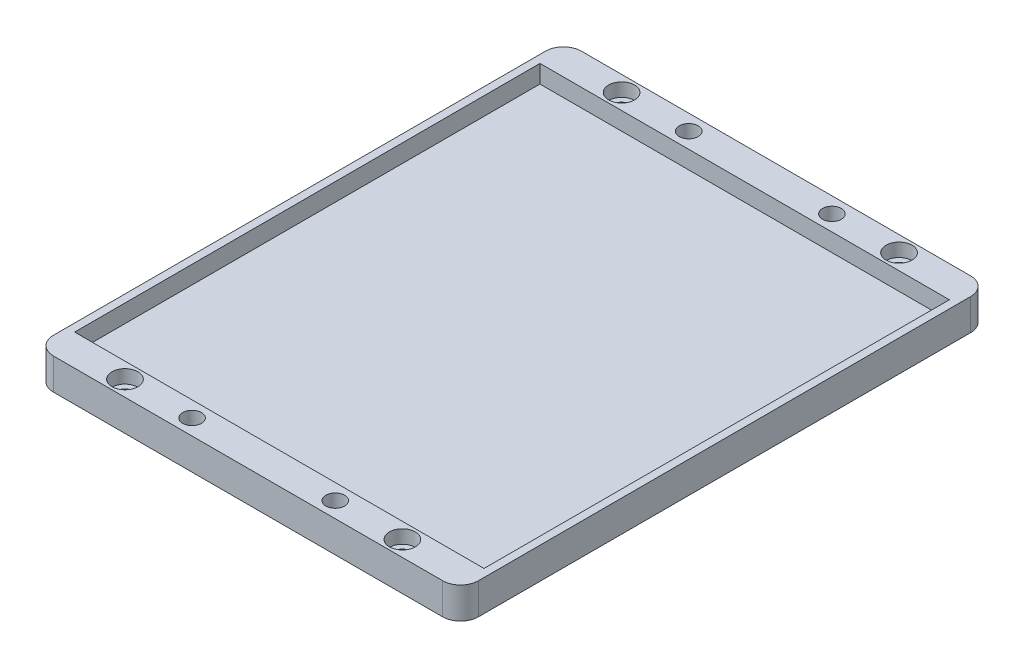
ISO-10303-21;
HEADER;
FILE_DESCRIPTION(('STEP AP214'),'2;1');
FILE_NAME('part.step','',(''),(''),'','','');
FILE_SCHEMA(('AUTOMOTIVE_DESIGN { 1 0 10303 214 1 1 1 1 }'));
ENDSEC;
DATA;
#1=APPLICATION_CONTEXT('core data for automotive mechanical design processes');
#2=APPLICATION_PROTOCOL_DEFINITION('international standard','automotive_design',2000,#1);
#3=PRODUCT_CONTEXT('',#1,'mechanical');
#4=PRODUCT('Part','Part','',(#3));
#5=PRODUCT_RELATED_PRODUCT_CATEGORY('part','',(#4));
#6=PRODUCT_DEFINITION_FORMATION('','',#4);
#7=PRODUCT_DEFINITION_CONTEXT('part definition',#1,'design');
#8=PRODUCT_DEFINITION('design','',#6,#7);
#9=PRODUCT_DEFINITION_SHAPE('','',#8);
#10=(LENGTH_UNIT() NAMED_UNIT(*) SI_UNIT(.MILLI.,.METRE.));
#11=(NAMED_UNIT(*) PLANE_ANGLE_UNIT() SI_UNIT($,.RADIAN.));
#12=(NAMED_UNIT(*) SI_UNIT($,.STERADIAN.) SOLID_ANGLE_UNIT());
#13=UNCERTAINTY_MEASURE_WITH_UNIT(LENGTH_MEASURE(1.E-05),#10,'distance_accuracy_value','');
#14=(GEOMETRIC_REPRESENTATION_CONTEXT(3) GLOBAL_UNCERTAINTY_ASSIGNED_CONTEXT((#13)) GLOBAL_UNIT_ASSIGNED_CONTEXT((#10,
#11,#12)) REPRESENTATION_CONTEXT('',''));
#15=CARTESIAN_POINT('',(0.,0.,0.));
#16=DIRECTION('',(0.,0.,1.));
#17=DIRECTION('',(1.,0.,0.));
#18=AXIS2_PLACEMENT_3D('',#15,#16,#17);
#19=CARTESIAN_POINT('',(31.,0.,-55.5));
#20=DIRECTION('',(0.,1.,0.));
#21=DIRECTION('',(0.,0.,1.));
#22=AXIS2_PLACEMENT_3D('',#19,#20,#21);
#23=CYLINDRICAL_SURFACE('',#22,1.60000000000001);
#24=CARTESIAN_POINT('',(31.,0.,-55.5));
#25=DIRECTION('',(0.,1.,0.));
#26=DIRECTION('',(0.,0.,-1.));
#27=AXIS2_PLACEMENT_3D('',#24,#25,#26);
#28=CIRCLE('',#27,1.60000000000001);
#29=CARTESIAN_POINT('',(31.,0.,-57.1));
#30=VERTEX_POINT('',#29);
#31=EDGE_CURVE('E292',#30,#30,#28,.T.);
#32=ORIENTED_EDGE('',*,*,#31,.F.);
#33=EDGE_LOOP('',(#32));
#34=FACE_BOUND('',#33,.T.);
#35=CARTESIAN_POINT('',(31.,4.,-55.5));
#36=DIRECTION('',(0.,1.,0.));
#37=DIRECTION('',(0.,0.,1.));
#38=AXIS2_PLACEMENT_3D('',#35,#36,#37);
#39=CIRCLE('',#38,1.60000000000001);
#40=CARTESIAN_POINT('',(31.,4.,-53.9));
#41=VERTEX_POINT('',#40);
#42=EDGE_CURVE('E276',#41,#41,#39,.F.);
#43=ORIENTED_EDGE('',*,*,#42,.F.);
#44=EDGE_LOOP('',(#43));
#45=FACE_BOUND('',#44,.T.);
#46=ADVANCED_FACE('F47',(#34,#45),#23,.F.);
#47=CARTESIAN_POINT('',(-31.,0.,55.5));
#48=DIRECTION('',(0.,1.,0.));
#49=DIRECTION('',(0.,0.,1.));
#50=AXIS2_PLACEMENT_3D('',#47,#48,#49);
#51=CYLINDRICAL_SURFACE('',#50,1.6);
#52=CARTESIAN_POINT('',(-31.,0.,55.5));
#53=DIRECTION('',(0.,1.,0.));
#54=DIRECTION('',(0.,0.,1.));
#55=AXIS2_PLACEMENT_3D('',#52,#53,#54);
#56=CIRCLE('',#55,1.6);
#57=CARTESIAN_POINT('',(-31.,0.,57.1));
#58=VERTEX_POINT('',#57);
#59=EDGE_CURVE('E298',#58,#58,#56,.T.);
#60=ORIENTED_EDGE('',*,*,#59,.F.);
#61=EDGE_LOOP('',(#60));
#62=FACE_BOUND('',#61,.T.);
#63=CARTESIAN_POINT('',(-31.,4.,55.5));
#64=DIRECTION('',(0.,1.,0.));
#65=DIRECTION('',(0.,0.,1.));
#66=AXIS2_PLACEMENT_3D('',#63,#64,#65);
#67=CIRCLE('',#66,1.6);
#68=CARTESIAN_POINT('',(-31.,4.,57.1));
#69=VERTEX_POINT('',#68);
#70=EDGE_CURVE('E272',#69,#69,#67,.F.);
#71=ORIENTED_EDGE('',*,*,#70,.F.);
#72=EDGE_LOOP('',(#71));
#73=FACE_BOUND('',#72,.T.);
#74=ADVANCED_FACE('F328',(#62,#73),#51,.F.);
#75=CARTESIAN_POINT('',(47.5,7.,-59.));
#76=DIRECTION('',(-1.,0.,0.));
#77=DIRECTION('',(0.,0.,1.));
#78=AXIS2_PLACEMENT_3D('',#75,#76,#77);
#79=PLANE('',#78);
#80=DIRECTION('',(0.,0.,-1.));
#81=VECTOR('',#80,1.);
#82=CARTESIAN_POINT('',(47.5,0.,-59.));
#83=LINE('',#82,#81);
#84=CARTESIAN_POINT('',(47.5,0.,55.));
#85=VERTEX_POINT('',#84);
#86=CARTESIAN_POINT('',(47.5,0.,-55.));
#87=VERTEX_POINT('',#86);
#88=EDGE_CURVE('E191',#85,#87,#83,.T.);
#89=ORIENTED_EDGE('',*,*,#88,.T.);
#90=DIRECTION('',(0.,-1.,0.));
#91=VECTOR('',#90,1.);
#92=CARTESIAN_POINT('',(47.5,7.,-55.));
#93=LINE('',#92,#91);
#94=CARTESIAN_POINT('',(47.5,7.,-55.));
#95=VERTEX_POINT('',#94);
#96=EDGE_CURVE('E248',#87,#95,#93,.F.);
#97=ORIENTED_EDGE('',*,*,#96,.T.);
#98=DIRECTION('',(0.,0.,-1.));
#99=VECTOR('',#98,1.);
#100=CARTESIAN_POINT('',(47.5,7.,-59.));
#101=LINE('',#100,#99);
#102=CARTESIAN_POINT('',(47.5,7.,55.));
#103=VERTEX_POINT('',#102);
#104=EDGE_CURVE('E197',#103,#95,#101,.T.);
#105=ORIENTED_EDGE('',*,*,#104,.F.);
#106=DIRECTION('',(0.,-1.,0.));
#107=VECTOR('',#106,1.);
#108=CARTESIAN_POINT('',(47.5,7.,55.));
#109=LINE('',#108,#107);
#110=EDGE_CURVE('E244',#103,#85,#109,.T.);
#111=ORIENTED_EDGE('',*,*,#110,.T.);
#112=EDGE_LOOP('',(#89,#97,#105,#111));
#113=FACE_BOUND('',#112,.T.);
#114=ADVANCED_FACE('F333',(#113),#79,.F.);
#115=CARTESIAN_POINT('',(-47.5,7.,-59.));
#116=DIRECTION('',(0.,0.,1.));
#117=DIRECTION('',(1.,0.,0.));
#118=AXIS2_PLACEMENT_3D('',#115,#116,#117);
#119=PLANE('',#118);
#120=DIRECTION('',(-1.,0.,0.));
#121=VECTOR('',#120,1.);
#122=CARTESIAN_POINT('',(-47.5,7.,-59.));
#123=LINE('',#122,#121);
#124=CARTESIAN_POINT('',(43.5,7.,-59.));
#125=VERTEX_POINT('',#124);
#126=CARTESIAN_POINT('',(-43.5,7.,-59.));
#127=VERTEX_POINT('',#126);
#128=EDGE_CURVE('E201',#125,#127,#123,.T.);
#129=ORIENTED_EDGE('',*,*,#128,.F.);
#130=DIRECTION('',(0.,-1.,0.));
#131=VECTOR('',#130,1.);
#132=CARTESIAN_POINT('',(43.5,7.,-59.));
#133=LINE('',#132,#131);
#134=CARTESIAN_POINT('',(43.5,0.,-59.));
#135=VERTEX_POINT('',#134);
#136=EDGE_CURVE('E228',#125,#135,#133,.T.);
#137=ORIENTED_EDGE('',*,*,#136,.T.);
#138=DIRECTION('',(-1.,0.,0.));
#139=VECTOR('',#138,1.);
#140=CARTESIAN_POINT('',(-47.5,0.,-59.));
#141=LINE('',#140,#139);
#142=CARTESIAN_POINT('',(-43.5,0.,-59.));
#143=VERTEX_POINT('',#142);
#144=EDGE_CURVE('E216',#135,#143,#141,.T.);
#145=ORIENTED_EDGE('',*,*,#144,.T.);
#146=DIRECTION('',(0.,-1.,0.));
#147=VECTOR('',#146,1.);
#148=CARTESIAN_POINT('',(-43.5,7.,-59.));
#149=LINE('',#148,#147);
#150=EDGE_CURVE('E212',#143,#127,#149,.F.);
#151=ORIENTED_EDGE('',*,*,#150,.T.);
#152=EDGE_LOOP('',(#129,#137,#145,#151));
#153=FACE_BOUND('',#152,.T.);
#154=ADVANCED_FACE('F490',(#153),#119,.F.);
#155=CARTESIAN_POINT('',(-47.5,7.,-59.));
#156=DIRECTION('',(1.,0.,0.));
#157=DIRECTION('',(0.,0.,-1.));
#158=AXIS2_PLACEMENT_3D('',#155,#156,#157);
#159=PLANE('',#158);
#160=DIRECTION('',(0.,0.,1.));
#161=VECTOR('',#160,1.);
#162=CARTESIAN_POINT('',(-47.5,7.,-59.));
#163=LINE('',#162,#161);
#164=CARTESIAN_POINT('',(-47.5,7.,-55.));
#165=VERTEX_POINT('',#164);
#166=CARTESIAN_POINT('',(-47.5,7.,55.));
#167=VERTEX_POINT('',#166);
#168=EDGE_CURVE('E206',#165,#167,#163,.T.);
#169=ORIENTED_EDGE('',*,*,#168,.F.);
#170=DIRECTION('',(0.,-1.,0.));
#171=VECTOR('',#170,1.);
#172=CARTESIAN_POINT('',(-47.5,7.,-55.));
#173=LINE('',#172,#171);
#174=CARTESIAN_POINT('',(-47.5,0.,-55.));
#175=VERTEX_POINT('',#174);
#176=EDGE_CURVE('E265',#165,#175,#173,.T.);
#177=ORIENTED_EDGE('',*,*,#176,.T.);
#178=DIRECTION('',(0.,0.,1.));
#179=VECTOR('',#178,1.);
#180=CARTESIAN_POINT('',(-47.5,0.,-59.));
#181=LINE('',#180,#179);
#182=CARTESIAN_POINT('',(-47.5,0.,55.));
#183=VERTEX_POINT('',#182);
#184=EDGE_CURVE('E220',#175,#183,#181,.T.);
#185=ORIENTED_EDGE('',*,*,#184,.T.);
#186=DIRECTION('',(0.,-1.,0.));
#187=VECTOR('',#186,1.);
#188=CARTESIAN_POINT('',(-47.5,7.,55.));
#189=LINE('',#188,#187);
#190=EDGE_CURVE('E262',#183,#167,#189,.F.);
#191=ORIENTED_EDGE('',*,*,#190,.T.);
#192=EDGE_LOOP('',(#169,#177,#185,#191));
#193=FACE_BOUND('',#192,.T.);
#194=ADVANCED_FACE('F500',(#193),#159,.F.);
#195=CARTESIAN_POINT('',(-47.5,7.,59.));
#196=DIRECTION('',(0.,0.,-1.));
#197=DIRECTION('',(-1.,0.,0.));
#198=AXIS2_PLACEMENT_3D('',#195,#196,#197);
#199=PLANE('',#198);
#200=DIRECTION('',(1.,0.,0.));
#201=VECTOR('',#200,1.);
#202=CARTESIAN_POINT('',(-47.5,0.,59.));
#203=LINE('',#202,#201);
#204=CARTESIAN_POINT('',(-43.5,0.,59.));
#205=VERTEX_POINT('',#204);
#206=CARTESIAN_POINT('',(43.5,0.,59.));
#207=VERTEX_POINT('',#206);
#208=EDGE_CURVE('E202',#205,#207,#203,.T.);
#209=ORIENTED_EDGE('',*,*,#208,.T.);
#210=DIRECTION('',(0.,-1.,0.));
#211=VECTOR('',#210,1.);
#212=CARTESIAN_POINT('',(43.5,7.,59.));
#213=LINE('',#212,#211);
#214=CARTESIAN_POINT('',(43.5,7.,59.));
#215=VERTEX_POINT('',#214);
#216=EDGE_CURVE('E11',#207,#215,#213,.F.);
#217=ORIENTED_EDGE('',*,*,#216,.T.);
#218=DIRECTION('',(1.,0.,0.));
#219=VECTOR('',#218,1.);
#220=CARTESIAN_POINT('',(-47.5,7.,59.));
#221=LINE('',#220,#219);
#222=CARTESIAN_POINT('',(-43.5,7.,59.));
#223=VERTEX_POINT('',#222);
#224=EDGE_CURVE('E209',#223,#215,#221,.T.);
#225=ORIENTED_EDGE('',*,*,#224,.F.);
#226=DIRECTION('',(0.,-1.,0.));
#227=VECTOR('',#226,1.);
#228=CARTESIAN_POINT('',(-43.5,7.,59.));
#229=LINE('',#228,#227);
#230=EDGE_CURVE('E57',#223,#205,#229,.T.);
#231=ORIENTED_EDGE('',*,*,#230,.T.);
#232=EDGE_LOOP('',(#209,#217,#225,#231));
#233=FACE_BOUND('',#232,.T.);
#234=ADVANCED_FACE('F475',(#233),#199,.F.);
#235=CARTESIAN_POINT('',(0.,7.,0.));
#236=DIRECTION('',(0.,1.,0.));
#237=DIRECTION('',(0.,0.,1.));
#238=AXIS2_PLACEMENT_3D('',#235,#236,#237);
#239=PLANE('',#238);
#240=CARTESIAN_POINT('',(16.,7.,55.5));
#241=DIRECTION('',(0.,1.,0.));
#242=DIRECTION('',(0.,0.,-1.));
#243=AXIS2_PLACEMENT_3D('',#240,#241,#242);
#244=CIRCLE('',#243,2.1);
#245=CARTESIAN_POINT('',(16.,7.,53.4));
#246=VERTEX_POINT('',#245);
#247=EDGE_CURVE('E430',#246,#246,#244,.T.);
#248=ORIENTED_EDGE('',*,*,#247,.F.);
#249=EDGE_LOOP('',(#248));
#250=FACE_BOUND('',#249,.T.);
#251=CARTESIAN_POINT('',(16.,7.,-55.5));
#252=DIRECTION('',(0.,1.,0.));
#253=DIRECTION('',(0.,0.,1.));
#254=AXIS2_PLACEMENT_3D('',#251,#252,#253);
#255=CIRCLE('',#254,2.1);
#256=CARTESIAN_POINT('',(16.,7.,-53.4));
#257=VERTEX_POINT('',#256);
#258=EDGE_CURVE('E420',#257,#257,#255,.T.);
#259=ORIENTED_EDGE('',*,*,#258,.F.);
#260=EDGE_LOOP('',(#259));
#261=FACE_BOUND('',#260,.T.);
#262=CARTESIAN_POINT('',(-16.,7.,-55.5));
#263=DIRECTION('',(0.,1.,0.));
#264=DIRECTION('',(0.,0.,-1.));
#265=AXIS2_PLACEMENT_3D('',#262,#263,#264);
#266=CIRCLE('',#265,2.1);
#267=CARTESIAN_POINT('',(-16.,7.,-57.6));
#268=VERTEX_POINT('',#267);
#269=EDGE_CURVE('E410',#268,#268,#266,.T.);
#270=ORIENTED_EDGE('',*,*,#269,.F.);
#271=EDGE_LOOP('',(#270));
#272=FACE_BOUND('',#271,.T.);
#273=CARTESIAN_POINT('',(-16.,7.,55.5));
#274=DIRECTION('',(0.,1.,0.));
#275=DIRECTION('',(0.,0.,1.));
#276=AXIS2_PLACEMENT_3D('',#273,#274,#275);
#277=CIRCLE('',#276,2.1);
#278=CARTESIAN_POINT('',(-16.,7.,57.6));
#279=VERTEX_POINT('',#278);
#280=EDGE_CURVE('E413',#279,#279,#277,.T.);
#281=ORIENTED_EDGE('',*,*,#280,.F.);
#282=EDGE_LOOP('',(#281));
#283=FACE_BOUND('',#282,.T.);
#284=CARTESIAN_POINT('',(-31.,7.,-55.5));
#285=DIRECTION('',(0.,1.,0.));
#286=DIRECTION('',(0.,0.,-1.));
#287=AXIS2_PLACEMENT_3D('',#284,#285,#286);
#288=CIRCLE('',#287,2.9);
#289=CARTESIAN_POINT('',(-31.,7.,-58.4));
#290=VERTEX_POINT('',#289);
#291=EDGE_CURVE('E450',#290,#290,#288,.T.);
#292=ORIENTED_EDGE('',*,*,#291,.F.);
#293=EDGE_LOOP('',(#292));
#294=FACE_BOUND('',#293,.T.);
#295=CARTESIAN_POINT('',(31.,7.,55.5));
#296=DIRECTION('',(0.,1.,0.));
#297=DIRECTION('',(0.,0.,-1.));
#298=AXIS2_PLACEMENT_3D('',#295,#296,#297);
#299=CIRCLE('',#298,2.9);
#300=CARTESIAN_POINT('',(31.,7.,52.6));
#301=VERTEX_POINT('',#300);
#302=EDGE_CURVE('E458',#301,#301,#299,.T.);
#303=ORIENTED_EDGE('',*,*,#302,.F.);
#304=EDGE_LOOP('',(#303));
#305=FACE_BOUND('',#304,.T.);
#306=CARTESIAN_POINT('',(31.,7.,-55.5));
#307=DIRECTION('',(0.,1.,0.));
#308=DIRECTION('',(0.,0.,1.));
#309=AXIS2_PLACEMENT_3D('',#306,#307,#308);
#310=CIRCLE('',#309,2.9);
#311=CARTESIAN_POINT('',(31.,7.,-52.6));
#312=VERTEX_POINT('',#311);
#313=EDGE_CURVE('E442',#312,#312,#310,.T.);
#314=ORIENTED_EDGE('',*,*,#313,.F.);
#315=EDGE_LOOP('',(#314));
#316=FACE_BOUND('',#315,.T.);
#317=CARTESIAN_POINT('',(-31.,7.,55.5));
#318=DIRECTION('',(0.,1.,0.));
#319=DIRECTION('',(0.,0.,1.));
#320=AXIS2_PLACEMENT_3D('',#317,#318,#319);
#321=CIRCLE('',#320,2.9);
#322=CARTESIAN_POINT('',(-31.,7.,58.4));
#323=VERTEX_POINT('',#322);
#324=EDGE_CURVE('E301',#323,#323,#321,.T.);
#325=ORIENTED_EDGE('',*,*,#324,.F.);
#326=EDGE_LOOP('',(#325));
#327=FACE_BOUND('',#326,.T.);
#328=DIRECTION('',(0.,0.,-1.));
#329=VECTOR('',#328,1.);
#330=CARTESIAN_POINT('',(45.75,7.,52.));
#331=LINE('',#330,#329);
#332=CARTESIAN_POINT('',(45.75,7.,52.));
#333=VERTEX_POINT('',#332);
#334=CARTESIAN_POINT('',(45.75,7.,-52.));
#335=VERTEX_POINT('',#334);
#336=EDGE_CURVE('E146',#333,#335,#331,.T.);
#337=ORIENTED_EDGE('',*,*,#336,.F.);
#338=DIRECTION('',(1.,0.,0.));
#339=VECTOR('',#338,1.);
#340=CARTESIAN_POINT('',(-45.75,7.,52.));
#341=LINE('',#340,#339);
#342=CARTESIAN_POINT('',(-45.75,7.,52.));
#343=VERTEX_POINT('',#342);
#344=EDGE_CURVE('E166',#343,#333,#341,.T.);
#345=ORIENTED_EDGE('',*,*,#344,.F.);
#346=DIRECTION('',(0.,0.,1.));
#347=VECTOR('',#346,1.);
#348=CARTESIAN_POINT('',(-45.75,7.,52.));
#349=LINE('',#348,#347);
#350=CARTESIAN_POINT('',(-45.75,7.,-52.));
#351=VERTEX_POINT('',#350);
#352=EDGE_CURVE('E170',#351,#343,#349,.T.);
#353=ORIENTED_EDGE('',*,*,#352,.F.);
#354=DIRECTION('',(-1.,0.,0.));
#355=VECTOR('',#354,1.);
#356=CARTESIAN_POINT('',(-45.75,7.,-52.));
#357=LINE('',#356,#355);
#358=EDGE_CURVE('E182',#335,#351,#357,.T.);
#359=ORIENTED_EDGE('',*,*,#358,.F.);
#360=EDGE_LOOP('',(#337,#345,#353,#359));
#361=FACE_BOUND('',#360,.T.);
#362=ORIENTED_EDGE('',*,*,#104,.T.);
#363=CARTESIAN_POINT('',(43.5,7.,-55.));
#364=DIRECTION('',(0.,1.,0.));
#365=DIRECTION('',(0.,0.,1.));
#366=AXIS2_PLACEMENT_3D('',#363,#364,#365);
#367=CIRCLE('',#366,4.);
#368=EDGE_CURVE('E259',#95,#125,#367,.T.);
#369=ORIENTED_EDGE('',*,*,#368,.T.);
#370=ORIENTED_EDGE('',*,*,#128,.T.);
#371=CARTESIAN_POINT('',(-43.5,7.,-55.));
#372=DIRECTION('',(0.,1.,0.));
#373=DIRECTION('',(0.,0.,1.));
#374=AXIS2_PLACEMENT_3D('',#371,#372,#373);
#375=CIRCLE('',#374,4.);
#376=EDGE_CURVE('E256',#127,#165,#375,.T.);
#377=ORIENTED_EDGE('',*,*,#376,.T.);
#378=ORIENTED_EDGE('',*,*,#168,.T.);
#379=CARTESIAN_POINT('',(-43.5,7.,55.));
#380=DIRECTION('',(0.,1.,0.));
#381=DIRECTION('',(0.,0.,1.));
#382=AXIS2_PLACEMENT_3D('',#379,#380,#381);
#383=CIRCLE('',#382,4.);
#384=EDGE_CURVE('E70',#167,#223,#383,.T.);
#385=ORIENTED_EDGE('',*,*,#384,.T.);
#386=ORIENTED_EDGE('',*,*,#224,.T.);
#387=CARTESIAN_POINT('',(43.5,7.,55.));
#388=DIRECTION('',(0.,1.,0.));
#389=DIRECTION('',(0.,0.,1.));
#390=AXIS2_PLACEMENT_3D('',#387,#388,#389);
#391=CIRCLE('',#390,4.);
#392=EDGE_CURVE('E253',#215,#103,#391,.T.);
#393=ORIENTED_EDGE('',*,*,#392,.T.);
#394=EDGE_LOOP('',(#362,#369,#370,#377,#378,#385,#386,#393));
#395=FACE_BOUND('',#394,.T.);
#396=ADVANCED_FACE('F472',(#250,#261,#272,#283,#294,#305,#316,#327,#361,#395),#239,.T.);
#397=CARTESIAN_POINT('',(0.,0.,0.));
#398=DIRECTION('',(0.,1.,0.));
#399=DIRECTION('',(0.,0.,1.));
#400=AXIS2_PLACEMENT_3D('',#397,#398,#399);
#401=PLANE('',#400);
#402=ORIENTED_EDGE('',*,*,#59,.T.);
#403=EDGE_LOOP('',(#402));
#404=FACE_BOUND('',#403,.T.);
#405=ORIENTED_EDGE('',*,*,#31,.T.);
#406=EDGE_LOOP('',(#405));
#407=FACE_BOUND('',#406,.T.);
#408=CARTESIAN_POINT('',(-31.,0.,-55.5));
#409=DIRECTION('',(0.,1.,0.));
#410=DIRECTION('',(0.,0.,-1.));
#411=AXIS2_PLACEMENT_3D('',#408,#409,#410);
#412=CIRCLE('',#411,1.6);
#413=CARTESIAN_POINT('',(-31.,0.,-57.1));
#414=VERTEX_POINT('',#413);
#415=EDGE_CURVE('E287',#414,#414,#412,.T.);
#416=ORIENTED_EDGE('',*,*,#415,.T.);
#417=EDGE_LOOP('',(#416));
#418=FACE_BOUND('',#417,.T.);
#419=CARTESIAN_POINT('',(31.,0.,55.5));
#420=DIRECTION('',(0.,1.,0.));
#421=DIRECTION('',(0.,0.,1.));
#422=AXIS2_PLACEMENT_3D('',#419,#420,#421);
#423=CIRCLE('',#422,1.60000000000001);
#424=CARTESIAN_POINT('',(31.,0.,57.1));
#425=VERTEX_POINT('',#424);
#426=EDGE_CURVE('E173',#425,#425,#423,.T.);
#427=ORIENTED_EDGE('',*,*,#426,.T.);
#428=EDGE_LOOP('',(#427));
#429=FACE_BOUND('',#428,.T.);
#430=ORIENTED_EDGE('',*,*,#144,.F.);
#431=CARTESIAN_POINT('',(43.5,0.,-55.));
#432=DIRECTION('',(0.,1.,0.));
#433=DIRECTION('',(0.,0.,1.));
#434=AXIS2_PLACEMENT_3D('',#431,#432,#433);
#435=CIRCLE('',#434,4.);
#436=EDGE_CURVE('E241',#135,#87,#435,.F.);
#437=ORIENTED_EDGE('',*,*,#436,.T.);
#438=ORIENTED_EDGE('',*,*,#88,.F.);
#439=CARTESIAN_POINT('',(43.5,0.,55.));
#440=DIRECTION('',(0.,1.,0.));
#441=DIRECTION('',(0.,0.,1.));
#442=AXIS2_PLACEMENT_3D('',#439,#440,#441);
#443=CIRCLE('',#442,4.);
#444=EDGE_CURVE('E235',#85,#207,#443,.F.);
#445=ORIENTED_EDGE('',*,*,#444,.T.);
#446=ORIENTED_EDGE('',*,*,#208,.F.);
#447=CARTESIAN_POINT('',(-43.5,0.,55.));
#448=DIRECTION('',(0.,1.,0.));
#449=DIRECTION('',(0.,0.,1.));
#450=AXIS2_PLACEMENT_3D('',#447,#448,#449);
#451=CIRCLE('',#450,4.);
#452=EDGE_CURVE('E232',#205,#183,#451,.F.);
#453=ORIENTED_EDGE('',*,*,#452,.T.);
#454=ORIENTED_EDGE('',*,*,#184,.F.);
#455=CARTESIAN_POINT('',(-43.5,0.,-55.));
#456=DIRECTION('',(0.,1.,0.));
#457=DIRECTION('',(0.,0.,1.));
#458=AXIS2_PLACEMENT_3D('',#455,#456,#457);
#459=CIRCLE('',#458,4.);
#460=EDGE_CURVE('E238',#175,#143,#459,.F.);
#461=ORIENTED_EDGE('',*,*,#460,.T.);
#462=EDGE_LOOP('',(#430,#437,#438,#445,#446,#453,#454,#461));
#463=FACE_BOUND('',#462,.T.);
#464=ADVANCED_FACE('F311',(#404,#407,#418,#429,#463),#401,.F.);
#465=CARTESIAN_POINT('',(45.75,3.,52.));
#466=DIRECTION('',(1.,0.,0.));
#467=DIRECTION('',(0.,0.,-1.));
#468=AXIS2_PLACEMENT_3D('',#465,#466,#467);
#469=PLANE('',#468);
#470=ORIENTED_EDGE('',*,*,#336,.T.);
#471=DIRECTION('',(0.,1.,0.));
#472=VECTOR('',#471,1.);
#473=CARTESIAN_POINT('',(45.75,3.,-52.));
#474=LINE('',#473,#472);
#475=CARTESIAN_POINT('',(45.75,3.,-52.));
#476=VERTEX_POINT('',#475);
#477=EDGE_CURVE('E139',#476,#335,#474,.T.);
#478=ORIENTED_EDGE('',*,*,#477,.F.);
#479=DIRECTION('',(0.,0.,-1.));
#480=VECTOR('',#479,1.);
#481=CARTESIAN_POINT('',(45.75,3.,52.));
#482=LINE('',#481,#480);
#483=CARTESIAN_POINT('',(45.75,3.,52.));
#484=VERTEX_POINT('',#483);
#485=EDGE_CURVE('E143',#484,#476,#482,.T.);
#486=ORIENTED_EDGE('',*,*,#485,.F.);
#487=DIRECTION('',(0.,1.,0.));
#488=VECTOR('',#487,1.);
#489=CARTESIAN_POINT('',(45.75,3.,52.));
#490=LINE('',#489,#488);
#491=EDGE_CURVE('E188',#484,#333,#490,.T.);
#492=ORIENTED_EDGE('',*,*,#491,.T.);
#493=EDGE_LOOP('',(#470,#478,#486,#492));
#494=FACE_BOUND('',#493,.T.);
#495=ADVANCED_FACE('F141',(#494),#469,.F.);
#496=CARTESIAN_POINT('',(-45.75,3.,52.));
#497=DIRECTION('',(0.,0.,1.));
#498=DIRECTION('',(1.,0.,0.));
#499=AXIS2_PLACEMENT_3D('',#496,#497,#498);
#500=PLANE('',#499);
#501=ORIENTED_EDGE('',*,*,#344,.T.);
#502=ORIENTED_EDGE('',*,*,#491,.F.);
#503=DIRECTION('',(1.,0.,0.));
#504=VECTOR('',#503,1.);
#505=CARTESIAN_POINT('',(-45.75,3.,52.));
#506=LINE('',#505,#504);
#507=CARTESIAN_POINT('',(-45.75,3.,52.));
#508=VERTEX_POINT('',#507);
#509=EDGE_CURVE('E152',#508,#484,#506,.T.);
#510=ORIENTED_EDGE('',*,*,#509,.F.);
#511=DIRECTION('',(0.,1.,0.));
#512=VECTOR('',#511,1.);
#513=CARTESIAN_POINT('',(-45.75,3.,52.));
#514=LINE('',#513,#512);
#515=EDGE_CURVE('E192',#508,#343,#514,.T.);
#516=ORIENTED_EDGE('',*,*,#515,.T.);
#517=EDGE_LOOP('',(#501,#502,#510,#516));
#518=FACE_BOUND('',#517,.T.);
#519=ADVANCED_FACE('F660',(#518),#500,.F.);
#520=CARTESIAN_POINT('',(-45.75,3.,52.));
#521=DIRECTION('',(-1.,0.,0.));
#522=DIRECTION('',(0.,0.,1.));
#523=AXIS2_PLACEMENT_3D('',#520,#521,#522);
#524=PLANE('',#523);
#525=ORIENTED_EDGE('',*,*,#352,.T.);
#526=ORIENTED_EDGE('',*,*,#515,.F.);
#527=DIRECTION('',(0.,0.,1.));
#528=VECTOR('',#527,1.);
#529=CARTESIAN_POINT('',(-45.75,3.,52.));
#530=LINE('',#529,#528);
#531=CARTESIAN_POINT('',(-45.75,3.,-52.));
#532=VERTEX_POINT('',#531);
#533=EDGE_CURVE('E161',#532,#508,#530,.T.);
#534=ORIENTED_EDGE('',*,*,#533,.F.);
#535=DIRECTION('',(0.,1.,0.));
#536=VECTOR('',#535,1.);
#537=CARTESIAN_POINT('',(-45.75,3.,-52.));
#538=LINE('',#537,#536);
#539=EDGE_CURVE('E151',#532,#351,#538,.T.);
#540=ORIENTED_EDGE('',*,*,#539,.T.);
#541=EDGE_LOOP('',(#525,#526,#534,#540));
#542=FACE_BOUND('',#541,.T.);
#543=ADVANCED_FACE('F669',(#542),#524,.F.);
#544=CARTESIAN_POINT('',(-45.75,3.,-52.));
#545=DIRECTION('',(0.,0.,-1.));
#546=DIRECTION('',(-1.,0.,0.));
#547=AXIS2_PLACEMENT_3D('',#544,#545,#546);
#548=PLANE('',#547);
#549=ORIENTED_EDGE('',*,*,#358,.T.);
#550=ORIENTED_EDGE('',*,*,#539,.F.);
#551=DIRECTION('',(-1.,0.,0.));
#552=VECTOR('',#551,1.);
#553=CARTESIAN_POINT('',(-45.75,3.,-52.));
#554=LINE('',#553,#552);
#555=EDGE_CURVE('E155',#476,#532,#554,.T.);
#556=ORIENTED_EDGE('',*,*,#555,.F.);
#557=ORIENTED_EDGE('',*,*,#477,.T.);
#558=EDGE_LOOP('',(#549,#550,#556,#557));
#559=FACE_BOUND('',#558,.T.);
#560=ADVANCED_FACE('F156',(#559),#548,.F.);
#561=CARTESIAN_POINT('',(0.,3.,0.));
#562=DIRECTION('',(0.,-1.,0.));
#563=DIRECTION('',(0.,0.,-1.));
#564=AXIS2_PLACEMENT_3D('',#561,#562,#563);
#565=PLANE('',#564);
#566=ORIENTED_EDGE('',*,*,#485,.T.);
#567=ORIENTED_EDGE('',*,*,#555,.T.);
#568=ORIENTED_EDGE('',*,*,#533,.T.);
#569=ORIENTED_EDGE('',*,*,#509,.T.);
#570=EDGE_LOOP('',(#566,#567,#568,#569));
#571=FACE_BOUND('',#570,.T.);
#572=ADVANCED_FACE('F163',(#571),#565,.F.);
#573=CARTESIAN_POINT('',(31.,0.,55.5));
#574=DIRECTION('',(0.,1.,0.));
#575=DIRECTION('',(0.,0.,1.));
#576=AXIS2_PLACEMENT_3D('',#573,#574,#575);
#577=CYLINDRICAL_SURFACE('',#576,1.60000000000001);
#578=CARTESIAN_POINT('',(31.,4.,55.5));
#579=DIRECTION('',(0.,-1.,0.));
#580=DIRECTION('',(0.,0.,-1.));
#581=AXIS2_PLACEMENT_3D('',#578,#579,#580);
#582=CIRCLE('',#581,1.60000000000001);
#583=CARTESIAN_POINT('',(31.,4.,53.9));
#584=VERTEX_POINT('',#583);
#585=EDGE_CURVE('E51',#584,#584,#582,.F.);
#586=ORIENTED_EDGE('',*,*,#585,.T.);
#587=EDGE_LOOP('',(#586));
#588=FACE_BOUND('',#587,.T.);
#589=ORIENTED_EDGE('',*,*,#426,.F.);
#590=EDGE_LOOP('',(#589));
#591=FACE_BOUND('',#590,.T.);
#592=ADVANCED_FACE('F314',(#588,#591),#577,.F.);
#593=CARTESIAN_POINT('',(-31.,0.,-55.5));
#594=DIRECTION('',(0.,1.,0.));
#595=DIRECTION('',(0.,0.,1.));
#596=AXIS2_PLACEMENT_3D('',#593,#594,#595);
#597=CYLINDRICAL_SURFACE('',#596,1.6);
#598=CARTESIAN_POINT('',(-31.,4.,-55.5));
#599=DIRECTION('',(0.,-1.,0.));
#600=DIRECTION('',(0.,0.,-1.));
#601=AXIS2_PLACEMENT_3D('',#598,#599,#600);
#602=CIRCLE('',#601,1.6);
#603=CARTESIAN_POINT('',(-31.,4.,-57.1));
#604=VERTEX_POINT('',#603);
#605=EDGE_CURVE('E280',#604,#604,#602,.F.);
#606=ORIENTED_EDGE('',*,*,#605,.T.);
#607=EDGE_LOOP('',(#606));
#608=FACE_BOUND('',#607,.T.);
#609=ORIENTED_EDGE('',*,*,#415,.F.);
#610=EDGE_LOOP('',(#609));
#611=FACE_BOUND('',#610,.T.);
#612=ADVANCED_FACE('F316',(#608,#611),#597,.F.);
#613=CARTESIAN_POINT('',(43.5,7.,-55.));
#614=DIRECTION('',(0.,-1.,0.));
#615=DIRECTION('',(0.,0.,-1.));
#616=AXIS2_PLACEMENT_3D('',#613,#614,#615);
#617=CYLINDRICAL_SURFACE('',#616,4.);
#618=ORIENTED_EDGE('',*,*,#368,.F.);
#619=ORIENTED_EDGE('',*,*,#96,.F.);
#620=ORIENTED_EDGE('',*,*,#436,.F.);
#621=ORIENTED_EDGE('',*,*,#136,.F.);
#622=EDGE_LOOP('',(#618,#619,#620,#621));
#623=FACE_BOUND('',#622,.T.);
#624=ADVANCED_FACE('F322',(#623),#617,.T.);
#625=CARTESIAN_POINT('',(-43.5,7.,-55.));
#626=DIRECTION('',(0.,-1.,0.));
#627=DIRECTION('',(0.,0.,-1.));
#628=AXIS2_PLACEMENT_3D('',#625,#626,#627);
#629=CYLINDRICAL_SURFACE('',#628,4.);
#630=ORIENTED_EDGE('',*,*,#376,.F.);
#631=ORIENTED_EDGE('',*,*,#150,.F.);
#632=ORIENTED_EDGE('',*,*,#460,.F.);
#633=ORIENTED_EDGE('',*,*,#176,.F.);
#634=EDGE_LOOP('',(#630,#631,#632,#633));
#635=FACE_BOUND('',#634,.T.);
#636=ADVANCED_FACE('F497',(#635),#629,.T.);
#637=CARTESIAN_POINT('',(43.5,7.,55.));
#638=DIRECTION('',(0.,-1.,0.));
#639=DIRECTION('',(0.,0.,-1.));
#640=AXIS2_PLACEMENT_3D('',#637,#638,#639);
#641=CYLINDRICAL_SURFACE('',#640,4.);
#642=ORIENTED_EDGE('',*,*,#392,.F.);
#643=ORIENTED_EDGE('',*,*,#216,.F.);
#644=ORIENTED_EDGE('',*,*,#444,.F.);
#645=ORIENTED_EDGE('',*,*,#110,.F.);
#646=EDGE_LOOP('',(#642,#643,#644,#645));
#647=FACE_BOUND('',#646,.T.);
#648=ADVANCED_FACE('F506',(#647),#641,.T.);
#649=CARTESIAN_POINT('',(-43.5,7.,55.));
#650=DIRECTION('',(0.,-1.,0.));
#651=DIRECTION('',(0.,0.,-1.));
#652=AXIS2_PLACEMENT_3D('',#649,#650,#651);
#653=CYLINDRICAL_SURFACE('',#652,4.);
#654=ORIENTED_EDGE('',*,*,#384,.F.);
#655=ORIENTED_EDGE('',*,*,#190,.F.);
#656=ORIENTED_EDGE('',*,*,#452,.F.);
#657=ORIENTED_EDGE('',*,*,#230,.F.);
#658=EDGE_LOOP('',(#654,#655,#656,#657));
#659=FACE_BOUND('',#658,.T.);
#660=ADVANCED_FACE('F49',(#659),#653,.T.);
#661=CARTESIAN_POINT('',(-31.,4.,55.5));
#662=DIRECTION('',(0.,1.,0.));
#663=DIRECTION('',(0.,0.,1.));
#664=AXIS2_PLACEMENT_3D('',#661,#662,#663);
#665=PLANE('',#664);
#666=CARTESIAN_POINT('',(-31.,4.,55.5));
#667=DIRECTION('',(0.,1.,0.));
#668=DIRECTION('',(0.,0.,1.));
#669=AXIS2_PLACEMENT_3D('',#666,#667,#668);
#670=CIRCLE('',#669,2.9);
#671=CARTESIAN_POINT('',(-31.,4.,58.4));
#672=VERTEX_POINT('',#671);
#673=EDGE_CURVE('E277',#672,#672,#670,.T.);
#674=ORIENTED_EDGE('',*,*,#673,.T.);
#675=EDGE_LOOP('',(#674));
#676=FACE_BOUND('',#675,.T.);
#677=ORIENTED_EDGE('',*,*,#70,.T.);
#678=EDGE_LOOP('',(#677));
#679=FACE_BOUND('',#678,.T.);
#680=ADVANCED_FACE('F343',(#676,#679),#665,.T.);
#681=CARTESIAN_POINT('',(-31.,4.,55.5));
#682=DIRECTION('',(0.,1.,0.));
#683=DIRECTION('',(0.,0.,1.));
#684=AXIS2_PLACEMENT_3D('',#681,#682,#683);
#685=CYLINDRICAL_SURFACE('',#684,2.9);
#686=ORIENTED_EDGE('',*,*,#673,.F.);
#687=EDGE_LOOP('',(#686));
#688=FACE_BOUND('',#687,.T.);
#689=ORIENTED_EDGE('',*,*,#324,.T.);
#690=EDGE_LOOP('',(#689));
#691=FACE_BOUND('',#690,.T.);
#692=ADVANCED_FACE('F339',(#688,#691),#685,.F.);
#693=CARTESIAN_POINT('',(31.,4.,-55.5));
#694=DIRECTION('',(0.,1.,0.));
#695=DIRECTION('',(0.,0.,1.));
#696=AXIS2_PLACEMENT_3D('',#693,#694,#695);
#697=PLANE('',#696);
#698=CARTESIAN_POINT('',(31.,4.,-55.5));
#699=DIRECTION('',(0.,1.,0.));
#700=DIRECTION('',(0.,0.,1.));
#701=AXIS2_PLACEMENT_3D('',#698,#699,#700);
#702=CIRCLE('',#701,2.9);
#703=CARTESIAN_POINT('',(31.,4.,-52.6));
#704=VERTEX_POINT('',#703);
#705=EDGE_CURVE('E440',#704,#704,#702,.T.);
#706=ORIENTED_EDGE('',*,*,#705,.T.);
#707=EDGE_LOOP('',(#706));
#708=FACE_BOUND('',#707,.T.);
#709=ORIENTED_EDGE('',*,*,#42,.T.);
#710=EDGE_LOOP('',(#709));
#711=FACE_BOUND('',#710,.T.);
#712=ADVANCED_FACE('F342',(#708,#711),#697,.T.);
#713=CARTESIAN_POINT('',(31.,4.,-55.5));
#714=DIRECTION('',(0.,1.,0.));
#715=DIRECTION('',(0.,0.,1.));
#716=AXIS2_PLACEMENT_3D('',#713,#714,#715);
#717=CYLINDRICAL_SURFACE('',#716,2.9);
#718=ORIENTED_EDGE('',*,*,#705,.F.);
#719=EDGE_LOOP('',(#718));
#720=FACE_BOUND('',#719,.T.);
#721=ORIENTED_EDGE('',*,*,#313,.T.);
#722=EDGE_LOOP('',(#721));
#723=FACE_BOUND('',#722,.T.);
#724=ADVANCED_FACE('F361',(#720,#723),#717,.F.);
#725=CARTESIAN_POINT('',(-31.,4.,-55.5));
#726=DIRECTION('',(0.,-1.,0.));
#727=DIRECTION('',(0.,0.,-1.));
#728=AXIS2_PLACEMENT_3D('',#725,#726,#727);
#729=PLANE('',#728);
#730=CARTESIAN_POINT('',(-31.,4.,-55.5));
#731=DIRECTION('',(0.,1.,0.));
#732=DIRECTION('',(0.,0.,-1.));
#733=AXIS2_PLACEMENT_3D('',#730,#731,#732);
#734=CIRCLE('',#733,2.9);
#735=CARTESIAN_POINT('',(-31.,4.,-58.4));
#736=VERTEX_POINT('',#735);
#737=EDGE_CURVE('E454',#736,#736,#734,.T.);
#738=ORIENTED_EDGE('',*,*,#737,.T.);
#739=EDGE_LOOP('',(#738));
#740=FACE_BOUND('',#739,.T.);
#741=ORIENTED_EDGE('',*,*,#605,.F.);
#742=EDGE_LOOP('',(#741));
#743=FACE_BOUND('',#742,.T.);
#744=ADVANCED_FACE('F358',(#740,#743),#729,.F.);
#745=CARTESIAN_POINT('',(-31.,4.,-55.5));
#746=DIRECTION('',(0.,1.,0.));
#747=DIRECTION('',(0.,0.,1.));
#748=AXIS2_PLACEMENT_3D('',#745,#746,#747);
#749=CYLINDRICAL_SURFACE('',#748,2.9);
#750=ORIENTED_EDGE('',*,*,#737,.F.);
#751=EDGE_LOOP('',(#750));
#752=FACE_BOUND('',#751,.T.);
#753=ORIENTED_EDGE('',*,*,#291,.T.);
#754=EDGE_LOOP('',(#753));
#755=FACE_BOUND('',#754,.T.);
#756=ADVANCED_FACE('F352',(#752,#755),#749,.F.);
#757=CARTESIAN_POINT('',(31.,4.,55.5));
#758=DIRECTION('',(0.,-1.,0.));
#759=DIRECTION('',(0.,0.,-1.));
#760=AXIS2_PLACEMENT_3D('',#757,#758,#759);
#761=PLANE('',#760);
#762=CARTESIAN_POINT('',(31.,4.,55.5));
#763=DIRECTION('',(0.,1.,0.));
#764=DIRECTION('',(0.,0.,-1.));
#765=AXIS2_PLACEMENT_3D('',#762,#763,#764);
#766=CIRCLE('',#765,2.9);
#767=CARTESIAN_POINT('',(31.,4.,52.6));
#768=VERTEX_POINT('',#767);
#769=EDGE_CURVE('E446',#768,#768,#766,.T.);
#770=ORIENTED_EDGE('',*,*,#769,.T.);
#771=EDGE_LOOP('',(#770));
#772=FACE_BOUND('',#771,.T.);
#773=ORIENTED_EDGE('',*,*,#585,.F.);
#774=EDGE_LOOP('',(#773));
#775=FACE_BOUND('',#774,.T.);
#776=ADVANCED_FACE('F348',(#772,#775),#761,.F.);
#777=CARTESIAN_POINT('',(31.,4.,55.5));
#778=DIRECTION('',(0.,1.,0.));
#779=DIRECTION('',(0.,0.,1.));
#780=AXIS2_PLACEMENT_3D('',#777,#778,#779);
#781=CYLINDRICAL_SURFACE('',#780,2.9);
#782=ORIENTED_EDGE('',*,*,#769,.F.);
#783=EDGE_LOOP('',(#782));
#784=FACE_BOUND('',#783,.T.);
#785=ORIENTED_EDGE('',*,*,#302,.T.);
#786=EDGE_LOOP('',(#785));
#787=FACE_BOUND('',#786,.T.);
#788=ADVANCED_FACE('F351',(#784,#787),#781,.F.);
#789=CARTESIAN_POINT('',(-16.,1.,55.5));
#790=DIRECTION('',(0.,1.,0.));
#791=DIRECTION('',(0.,0.,1.));
#792=AXIS2_PLACEMENT_3D('',#789,#790,#791);
#793=CYLINDRICAL_SURFACE('',#792,2.1);
#794=CARTESIAN_POINT('',(-16.,1.,55.5));
#795=DIRECTION('',(0.,1.,0.));
#796=DIRECTION('',(0.,0.,1.));
#797=AXIS2_PLACEMENT_3D('',#794,#795,#796);
#798=CIRCLE('',#797,2.1);
#799=CARTESIAN_POINT('',(-16.,1.,57.6));
#800=VERTEX_POINT('',#799);
#801=EDGE_CURVE('E418',#800,#800,#798,.T.);
#802=ORIENTED_EDGE('',*,*,#801,.F.);
#803=EDGE_LOOP('',(#802));
#804=FACE_BOUND('',#803,.T.);
#805=ORIENTED_EDGE('',*,*,#280,.T.);
#806=EDGE_LOOP('',(#805));
#807=FACE_BOUND('',#806,.T.);
#808=ADVANCED_FACE('F356',(#804,#807),#793,.F.);
#809=CARTESIAN_POINT('',(-16.,1.,55.5));
#810=DIRECTION('',(0.,1.,0.));
#811=DIRECTION('',(0.,0.,1.));
#812=AXIS2_PLACEMENT_3D('',#809,#810,#811);
#813=PLANE('',#812);
#814=ORIENTED_EDGE('',*,*,#801,.T.);
#815=EDGE_LOOP('',(#814));
#816=FACE_BOUND('',#815,.T.);
#817=ADVANCED_FACE('F374',(#816),#813,.T.);
#818=CARTESIAN_POINT('',(-16.,1.,-55.5));
#819=DIRECTION('',(0.,1.,0.));
#820=DIRECTION('',(0.,0.,1.));
#821=AXIS2_PLACEMENT_3D('',#818,#819,#820);
#822=CYLINDRICAL_SURFACE('',#821,2.1);
#823=CARTESIAN_POINT('',(-16.,1.,-55.5));
#824=DIRECTION('',(0.,1.,0.));
#825=DIRECTION('',(0.,0.,-1.));
#826=AXIS2_PLACEMENT_3D('',#823,#824,#825);
#827=CIRCLE('',#826,2.1);
#828=CARTESIAN_POINT('',(-16.,1.,-57.6));
#829=VERTEX_POINT('',#828);
#830=EDGE_CURVE('E407',#829,#829,#827,.T.);
#831=ORIENTED_EDGE('',*,*,#830,.F.);
#832=EDGE_LOOP('',(#831));
#833=FACE_BOUND('',#832,.T.);
#834=ORIENTED_EDGE('',*,*,#269,.T.);
#835=EDGE_LOOP('',(#834));
#836=FACE_BOUND('',#835,.T.);
#837=ADVANCED_FACE('F378',(#833,#836),#822,.F.);
#838=CARTESIAN_POINT('',(-16.,1.,-55.5));
#839=DIRECTION('',(0.,-1.,0.));
#840=DIRECTION('',(0.,0.,-1.));
#841=AXIS2_PLACEMENT_3D('',#838,#839,#840);
#842=PLANE('',#841);
#843=ORIENTED_EDGE('',*,*,#830,.T.);
#844=EDGE_LOOP('',(#843));
#845=FACE_BOUND('',#844,.T.);
#846=ADVANCED_FACE('F395',(#845),#842,.F.);
#847=CARTESIAN_POINT('',(16.,1.,-55.5));
#848=DIRECTION('',(0.,1.,0.));
#849=DIRECTION('',(0.,0.,1.));
#850=AXIS2_PLACEMENT_3D('',#847,#848,#849);
#851=CYLINDRICAL_SURFACE('',#850,2.1);
#852=CARTESIAN_POINT('',(16.,1.,-55.5));
#853=DIRECTION('',(0.,1.,0.));
#854=DIRECTION('',(0.,0.,1.));
#855=AXIS2_PLACEMENT_3D('',#852,#853,#854);
#856=CIRCLE('',#855,2.1);
#857=CARTESIAN_POINT('',(16.,1.,-53.4));
#858=VERTEX_POINT('',#857);
#859=EDGE_CURVE('E426',#858,#858,#856,.T.);
#860=ORIENTED_EDGE('',*,*,#859,.F.);
#861=EDGE_LOOP('',(#860));
#862=FACE_BOUND('',#861,.T.);
#863=ORIENTED_EDGE('',*,*,#258,.T.);
#864=EDGE_LOOP('',(#863));
#865=FACE_BOUND('',#864,.T.);
#866=ADVANCED_FACE('F391',(#862,#865),#851,.F.);
#867=CARTESIAN_POINT('',(16.,1.,-55.5));
#868=DIRECTION('',(0.,1.,0.));
#869=DIRECTION('',(0.,0.,1.));
#870=AXIS2_PLACEMENT_3D('',#867,#868,#869);
#871=PLANE('',#870);
#872=ORIENTED_EDGE('',*,*,#859,.T.);
#873=EDGE_LOOP('',(#872));
#874=FACE_BOUND('',#873,.T.);
#875=ADVANCED_FACE('F387',(#874),#871,.T.);
#876=CARTESIAN_POINT('',(16.,1.,55.5));
#877=DIRECTION('',(0.,1.,0.));
#878=DIRECTION('',(0.,0.,1.));
#879=AXIS2_PLACEMENT_3D('',#876,#877,#878);
#880=CYLINDRICAL_SURFACE('',#879,2.1);
#881=CARTESIAN_POINT('',(16.,1.,55.5));
#882=DIRECTION('',(0.,1.,0.));
#883=DIRECTION('',(0.,0.,-1.));
#884=AXIS2_PLACEMENT_3D('',#881,#882,#883);
#885=CIRCLE('',#884,2.1);
#886=CARTESIAN_POINT('',(16.,1.,53.4));
#887=VERTEX_POINT('',#886);
#888=EDGE_CURVE('E434',#887,#887,#885,.T.);
#889=ORIENTED_EDGE('',*,*,#888,.F.);
#890=EDGE_LOOP('',(#889));
#891=FACE_BOUND('',#890,.T.);
#892=ORIENTED_EDGE('',*,*,#247,.T.);
#893=EDGE_LOOP('',(#892));
#894=FACE_BOUND('',#893,.T.);
#895=ADVANCED_FACE('F383',(#891,#894),#880,.F.);
#896=CARTESIAN_POINT('',(16.,1.,55.5));
#897=DIRECTION('',(0.,-1.,0.));
#898=DIRECTION('',(0.,0.,-1.));
#899=AXIS2_PLACEMENT_3D('',#896,#897,#898);
#900=PLANE('',#899);
#901=ORIENTED_EDGE('',*,*,#888,.T.);
#902=EDGE_LOOP('',(#901));
#903=FACE_BOUND('',#902,.T.);
#904=ADVANCED_FACE('F380',(#903),#900,.F.);
#905=CLOSED_SHELL('',(#46,#74,#114,#154,#194,#234,#396,#464,#495,#519,#543,#560,#572,#592,#612,
#624,#636,#648,#660,#680,#692,#712,#724,#744,#756,#776,#788,#808,#817,#837,#846,#866,#875,#895,#904));
#906=MANIFOLD_SOLID_BREP('B2',#905);
#907=ADVANCED_BREP_SHAPE_REPRESENTATION('',(#18,#906),#14);
#908=SHAPE_DEFINITION_REPRESENTATION(#9,#907);
ENDSEC;
END-ISO-10303-21;
